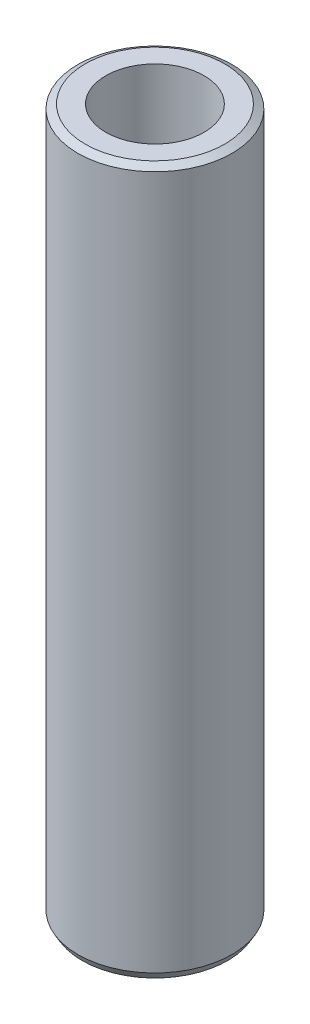
ISO-10303-21;
HEADER;
FILE_DESCRIPTION(('STEP AP214'),'2;1');
FILE_NAME('part.step','',(''),(''),'','','');
FILE_SCHEMA(('AUTOMOTIVE_DESIGN { 1 0 10303 214 1 1 1 1 }'));
ENDSEC;
DATA;
#1=APPLICATION_CONTEXT('core data for automotive mechanical design processes');
#2=APPLICATION_PROTOCOL_DEFINITION('international standard','automotive_design',2000,#1);
#3=PRODUCT_CONTEXT('',#1,'mechanical');
#4=PRODUCT('Part','Part','',(#3));
#5=PRODUCT_RELATED_PRODUCT_CATEGORY('part','',(#4));
#6=PRODUCT_DEFINITION_FORMATION('','',#4);
#7=PRODUCT_DEFINITION_CONTEXT('part definition',#1,'design');
#8=PRODUCT_DEFINITION('design','',#6,#7);
#9=PRODUCT_DEFINITION_SHAPE('','',#8);
#10=(LENGTH_UNIT() NAMED_UNIT(*) SI_UNIT(.MILLI.,.METRE.));
#11=(NAMED_UNIT(*) PLANE_ANGLE_UNIT() SI_UNIT($,.RADIAN.));
#12=(NAMED_UNIT(*) SI_UNIT($,.STERADIAN.) SOLID_ANGLE_UNIT());
#13=UNCERTAINTY_MEASURE_WITH_UNIT(LENGTH_MEASURE(1.E-05),#10,'distance_accuracy_value','');
#14=(GEOMETRIC_REPRESENTATION_CONTEXT(3) GLOBAL_UNCERTAINTY_ASSIGNED_CONTEXT((#13)) GLOBAL_UNIT_ASSIGNED_CONTEXT((#10,
#11,#12)) REPRESENTATION_CONTEXT('',''));
#15=CARTESIAN_POINT('',(0.,0.,0.));
#16=DIRECTION('',(0.,0.,1.));
#17=DIRECTION('',(1.,0.,0.));
#18=AXIS2_PLACEMENT_3D('',#15,#16,#17);
#19=CARTESIAN_POINT('',(0.,457.79938378923,0.));
#20=DIRECTION('',(0.,-1.,0.));
#21=DIRECTION('',(0.,0.,-1.));
#22=AXIS2_PLACEMENT_3D('',#19,#20,#21);
#23=CYLINDRICAL_SURFACE('',#22,50.);
#24=CARTESIAN_POINT('',(0.,455.03702489157,0.));
#25=DIRECTION('',(0.,1.,0.));
#26=DIRECTION('',(0.,0.,1.));
#27=AXIS2_PLACEMENT_3D('',#24,#25,#26);
#28=CIRCLE('',#27,50.);
#29=CARTESIAN_POINT('',(0.,455.03702489157,50.));
#30=VERTEX_POINT('',#29);
#31=EDGE_CURVE('E50',#30,#30,#28,.F.);
#32=ORIENTED_EDGE('',*,*,#31,.T.);
#33=EDGE_LOOP('',(#32));
#34=FACE_BOUND('',#33,.T.);
#35=CARTESIAN_POINT('',(0.,4.78454595948719,0.));
#36=DIRECTION('',(0.,1.,0.));
#37=DIRECTION('',(0.,0.,1.));
#38=AXIS2_PLACEMENT_3D('',#35,#36,#37);
#39=CIRCLE('',#38,50.);
#40=CARTESIAN_POINT('',(0.,4.78454595948719,50.));
#41=VERTEX_POINT('',#40);
#42=EDGE_CURVE('E51',#41,#41,#39,.T.);
#43=ORIENTED_EDGE('',*,*,#42,.T.);
#44=EDGE_LOOP('',(#43));
#45=FACE_BOUND('',#44,.T.);
#46=ADVANCED_FACE('F39',(#34,#45),#23,.T.);
#47=CARTESIAN_POINT('',(0.,457.79938378923,0.));
#48=DIRECTION('',(0.,1.,0.));
#49=DIRECTION('',(0.,0.,1.));
#50=AXIS2_PLACEMENT_3D('',#47,#48,#49);
#51=PLANE('',#50);
#52=CARTESIAN_POINT('',(0.,457.79938378923,0.));
#53=DIRECTION('',(0.,1.,0.));
#54=DIRECTION('',(0.,0.,1.));
#55=AXIS2_PLACEMENT_3D('',#52,#53,#54);
#56=CIRCLE('',#55,45.2154540405127);
#57=CARTESIAN_POINT('',(0.,457.79938378923,45.2154540405127));
#58=VERTEX_POINT('',#57);
#59=EDGE_CURVE('E54',#58,#58,#56,.T.);
#60=ORIENTED_EDGE('',*,*,#59,.T.);
#61=EDGE_LOOP('',(#60));
#62=FACE_BOUND('',#61,.T.);
#63=CARTESIAN_POINT('',(0.,457.79938378923,0.));
#64=DIRECTION('',(0.,1.,0.));
#65=DIRECTION('',(0.,0.,1.));
#66=AXIS2_PLACEMENT_3D('',#63,#64,#65);
#67=CIRCLE('',#66,31.8718532298172);
#68=CARTESIAN_POINT('',(0.,457.79938378923,31.8718532298172));
#69=VERTEX_POINT('',#68);
#70=EDGE_CURVE('E58',#69,#69,#67,.T.);
#71=ORIENTED_EDGE('',*,*,#70,.F.);
#72=EDGE_LOOP('',(#71));
#73=FACE_BOUND('',#72,.T.);
#74=ADVANCED_FACE('F69',(#62,#73),#51,.T.);
#75=CARTESIAN_POINT('',(0.,0.,0.));
#76=DIRECTION('',(0.,1.,0.));
#77=DIRECTION('',(0.,0.,1.));
#78=AXIS2_PLACEMENT_3D('',#75,#76,#77);
#79=PLANE('',#78);
#80=CARTESIAN_POINT('',(0.,0.,0.));
#81=DIRECTION('',(0.,1.,0.));
#82=DIRECTION('',(0.,0.,1.));
#83=AXIS2_PLACEMENT_3D('',#80,#81,#82);
#84=CIRCLE('',#83,47.2376411023399);
#85=CARTESIAN_POINT('',(0.,0.,47.2376411023399));
#86=VERTEX_POINT('',#85);
#87=EDGE_CURVE('E10',#86,#86,#84,.F.);
#88=ORIENTED_EDGE('',*,*,#87,.T.);
#89=EDGE_LOOP('',(#88));
#90=FACE_BOUND('',#89,.T.);
#91=CARTESIAN_POINT('',(0.,0.,0.));
#92=DIRECTION('',(0.,1.,0.));
#93=DIRECTION('',(0.,0.,1.));
#94=AXIS2_PLACEMENT_3D('',#91,#92,#93);
#95=CIRCLE('',#94,31.8718532298172);
#96=CARTESIAN_POINT('',(0.,0.,31.8718532298172));
#97=VERTEX_POINT('',#96);
#98=EDGE_CURVE('E63',#97,#97,#95,.T.);
#99=ORIENTED_EDGE('',*,*,#98,.T.);
#100=EDGE_LOOP('',(#99));
#101=FACE_BOUND('',#100,.T.);
#102=ADVANCED_FACE('F75',(#90,#101),#79,.F.);
#103=CARTESIAN_POINT('',(0.,457.79938378923,0.));
#104=DIRECTION('',(0.,-1.,0.));
#105=DIRECTION('',(0.,0.,-1.));
#106=AXIS2_PLACEMENT_3D('',#103,#104,#105);
#107=CYLINDRICAL_SURFACE('',#106,31.8718532298172);
#108=ORIENTED_EDGE('',*,*,#70,.T.);
#109=EDGE_LOOP('',(#108));
#110=FACE_BOUND('',#109,.T.);
#111=ORIENTED_EDGE('',*,*,#98,.F.);
#112=EDGE_LOOP('',(#111));
#113=FACE_BOUND('',#112,.T.);
#114=ADVANCED_FACE('F70',(#110,#113),#107,.F.);
#115=CARTESIAN_POINT('',(0.,457.79938378923,0.));
#116=DIRECTION('',(0.,-1.,0.));
#117=DIRECTION('',(0.,0.,-1.));
#118=AXIS2_PLACEMENT_3D('',#115,#116,#117);
#119=CONICAL_SURFACE('',#118,45.2154540405127,1.0471975511966);
#120=ORIENTED_EDGE('',*,*,#31,.F.);
#121=EDGE_LOOP('',(#120));
#122=FACE_BOUND('',#121,.T.);
#123=ORIENTED_EDGE('',*,*,#59,.F.);
#124=EDGE_LOOP('',(#123));
#125=FACE_BOUND('',#124,.T.);
#126=ADVANCED_FACE('F81',(#122,#125),#119,.T.);
#127=CARTESIAN_POINT('',(0.,4.78454595948719,0.));
#128=DIRECTION('',(0.,1.,0.));
#129=DIRECTION('',(0.,0.,1.));
#130=AXIS2_PLACEMENT_3D('',#127,#128,#129);
#131=CONICAL_SURFACE('',#130,50.,0.523598775598308);
#132=ORIENTED_EDGE('',*,*,#87,.F.);
#133=EDGE_LOOP('',(#132));
#134=FACE_BOUND('',#133,.T.);
#135=ORIENTED_EDGE('',*,*,#42,.F.);
#136=EDGE_LOOP('',(#135));
#137=FACE_BOUND('',#136,.T.);
#138=ADVANCED_FACE('F45',(#134,#137),#131,.T.);
#139=CLOSED_SHELL('',(#46,#74,#102,#114,#126,#138));
#140=MANIFOLD_SOLID_BREP('B2',#139);
#141=ADVANCED_BREP_SHAPE_REPRESENTATION('',(#18,#140),#14);
#142=SHAPE_DEFINITION_REPRESENTATION(#9,#141);
ENDSEC;
END-ISO-10303-21;
